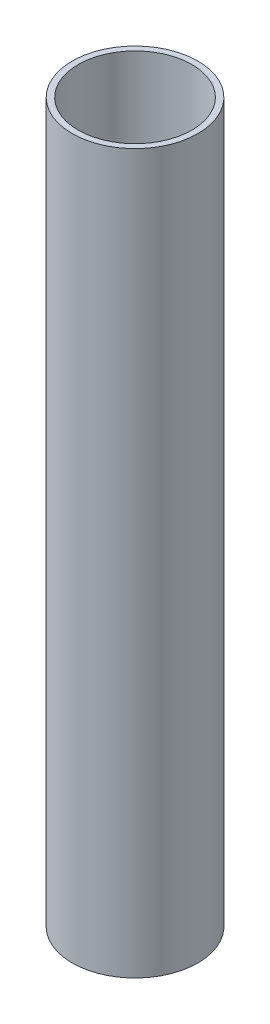
ISO-10303-21;
HEADER;
FILE_DESCRIPTION(('STEP AP214'),'2;1');
FILE_NAME('part.step','',(''),(''),'','','');
FILE_SCHEMA(('AUTOMOTIVE_DESIGN { 1 0 10303 214 1 1 1 1 }'));
ENDSEC;
DATA;
#1=APPLICATION_CONTEXT('core data for automotive mechanical design processes');
#2=APPLICATION_PROTOCOL_DEFINITION('international standard','automotive_design',2000,#1);
#3=PRODUCT_CONTEXT('',#1,'mechanical');
#4=PRODUCT('Part','Part','',(#3));
#5=PRODUCT_RELATED_PRODUCT_CATEGORY('part','',(#4));
#6=PRODUCT_DEFINITION_FORMATION('','',#4);
#7=PRODUCT_DEFINITION_CONTEXT('part definition',#1,'design');
#8=PRODUCT_DEFINITION('design','',#6,#7);
#9=PRODUCT_DEFINITION_SHAPE('','',#8);
#10=(LENGTH_UNIT() NAMED_UNIT(*) SI_UNIT(.MILLI.,.METRE.));
#11=(NAMED_UNIT(*) PLANE_ANGLE_UNIT() SI_UNIT($,.RADIAN.));
#12=(NAMED_UNIT(*) SI_UNIT($,.STERADIAN.) SOLID_ANGLE_UNIT());
#13=UNCERTAINTY_MEASURE_WITH_UNIT(LENGTH_MEASURE(1.E-05),#10,'distance_accuracy_value','');
#14=(GEOMETRIC_REPRESENTATION_CONTEXT(3) GLOBAL_UNCERTAINTY_ASSIGNED_CONTEXT((#13)) GLOBAL_UNIT_ASSIGNED_CONTEXT((#10,
#11,#12)) REPRESENTATION_CONTEXT('',''));
#15=CARTESIAN_POINT('',(0.,0.,0.));
#16=DIRECTION('',(0.,0.,1.));
#17=DIRECTION('',(1.,0.,0.));
#18=AXIS2_PLACEMENT_3D('',#15,#16,#17);
#19=CARTESIAN_POINT('',(0.,240.,0.));
#20=DIRECTION('',(0.,1.,0.));
#21=DIRECTION('',(0.,0.,1.));
#22=AXIS2_PLACEMENT_3D('',#19,#20,#21);
#23=PLANE('',#22);
#24=CARTESIAN_POINT('',(0.,240.,0.));
#25=DIRECTION('',(0.,1.,0.));
#26=DIRECTION('',(1.,0.,0.));
#27=AXIS2_PLACEMENT_3D('',#24,#25,#26);
#28=CIRCLE('',#27,21.);
#29=CARTESIAN_POINT('',(21.,240.,0.));
#30=VERTEX_POINT('',#29);
#31=EDGE_CURVE('E11',#30,#30,#28,.T.);
#32=ORIENTED_EDGE('',*,*,#31,.T.);
#33=EDGE_LOOP('',(#32));
#34=FACE_BOUND('',#33,.T.);
#35=CARTESIAN_POINT('',(0.,240.,0.));
#36=DIRECTION('',(0.,1.,0.));
#37=DIRECTION('',(0.,0.,1.));
#38=AXIS2_PLACEMENT_3D('',#35,#36,#37);
#39=CIRCLE('',#38,19.);
#40=CARTESIAN_POINT('',(0.,240.,19.));
#41=VERTEX_POINT('',#40);
#42=EDGE_CURVE('E58',#41,#41,#39,.T.);
#43=ORIENTED_EDGE('',*,*,#42,.F.);
#44=EDGE_LOOP('',(#43));
#45=FACE_BOUND('',#44,.T.);
#46=ADVANCED_FACE('F45',(#34,#45),#23,.T.);
#47=CARTESIAN_POINT('',(0.,0.,0.));
#48=DIRECTION('',(0.,1.,0.));
#49=DIRECTION('',(0.,0.,1.));
#50=AXIS2_PLACEMENT_3D('',#47,#48,#49);
#51=PLANE('',#50);
#52=CARTESIAN_POINT('',(0.,0.,0.));
#53=DIRECTION('',(0.,1.,0.));
#54=DIRECTION('',(1.,0.,0.));
#55=AXIS2_PLACEMENT_3D('',#52,#53,#54);
#56=CIRCLE('',#55,21.);
#57=CARTESIAN_POINT('',(21.,0.,0.));
#58=VERTEX_POINT('',#57);
#59=EDGE_CURVE('E49',#58,#58,#56,.T.);
#60=ORIENTED_EDGE('',*,*,#59,.F.);
#61=EDGE_LOOP('',(#60));
#62=FACE_BOUND('',#61,.T.);
#63=CARTESIAN_POINT('',(0.,0.,0.));
#64=DIRECTION('',(0.,1.,0.));
#65=DIRECTION('',(0.,0.,1.));
#66=AXIS2_PLACEMENT_3D('',#63,#64,#65);
#67=CIRCLE('',#66,19.);
#68=CARTESIAN_POINT('',(0.,0.,19.));
#69=VERTEX_POINT('',#68);
#70=EDGE_CURVE('E60',#69,#69,#67,.T.);
#71=ORIENTED_EDGE('',*,*,#70,.T.);
#72=EDGE_LOOP('',(#71));
#73=FACE_BOUND('',#72,.T.);
#74=ADVANCED_FACE('F72',(#62,#73),#51,.F.);
#75=CARTESIAN_POINT('',(0.,240.,0.));
#76=DIRECTION('',(0.,-1.,0.));
#77=DIRECTION('',(0.,0.,-1.));
#78=AXIS2_PLACEMENT_3D('',#75,#76,#77);
#79=CYLINDRICAL_SURFACE('',#78,21.);
#80=ORIENTED_EDGE('',*,*,#31,.F.);
#81=EDGE_LOOP('',(#80));
#82=FACE_BOUND('',#81,.T.);
#83=ORIENTED_EDGE('',*,*,#59,.T.);
#84=EDGE_LOOP('',(#83));
#85=FACE_BOUND('',#84,.T.);
#86=ADVANCED_FACE('F47',(#82,#85),#79,.T.);
#87=CARTESIAN_POINT('',(0.,240.,0.));
#88=DIRECTION('',(0.,-1.,0.));
#89=DIRECTION('',(0.,0.,-1.));
#90=AXIS2_PLACEMENT_3D('',#87,#88,#89);
#91=CYLINDRICAL_SURFACE('',#90,19.);
#92=ORIENTED_EDGE('',*,*,#42,.T.);
#93=EDGE_LOOP('',(#92));
#94=FACE_BOUND('',#93,.T.);
#95=ORIENTED_EDGE('',*,*,#70,.F.);
#96=EDGE_LOOP('',(#95));
#97=FACE_BOUND('',#96,.T.);
#98=ADVANCED_FACE('F68',(#94,#97),#91,.F.);
#99=CLOSED_SHELL('',(#46,#74,#86,#98));
#100=MANIFOLD_SOLID_BREP('B2',#99);
#101=ADVANCED_BREP_SHAPE_REPRESENTATION('',(#18,#100),#14);
#102=SHAPE_DEFINITION_REPRESENTATION(#9,#101);
ENDSEC;
END-ISO-10303-21;
